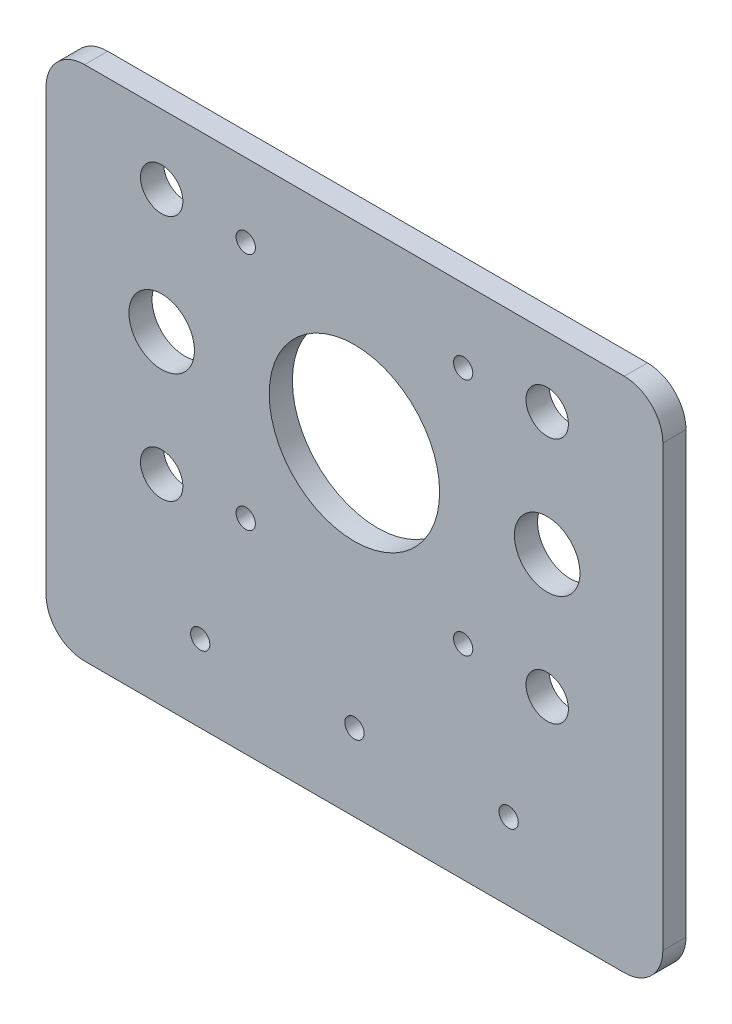
ISO-10303-21;
HEADER;
FILE_DESCRIPTION(('STEP AP214'),'2;1');
FILE_NAME('part.step','',(''),(''),'','','');
FILE_SCHEMA(('AUTOMOTIVE_DESIGN { 1 0 10303 214 1 1 1 1 }'));
ENDSEC;
DATA;
#1=APPLICATION_CONTEXT('core data for automotive mechanical design processes');
#2=APPLICATION_PROTOCOL_DEFINITION('international standard','automotive_design',2000,#1);
#3=PRODUCT_CONTEXT('',#1,'mechanical');
#4=PRODUCT('Part','Part','',(#3));
#5=PRODUCT_RELATED_PRODUCT_CATEGORY('part','',(#4));
#6=PRODUCT_DEFINITION_FORMATION('','',#4);
#7=PRODUCT_DEFINITION_CONTEXT('part definition',#1,'design');
#8=PRODUCT_DEFINITION('design','',#6,#7);
#9=PRODUCT_DEFINITION_SHAPE('','',#8);
#10=(LENGTH_UNIT() NAMED_UNIT(*) SI_UNIT(.MILLI.,.METRE.));
#11=(NAMED_UNIT(*) PLANE_ANGLE_UNIT() SI_UNIT($,.RADIAN.));
#12=(NAMED_UNIT(*) SI_UNIT($,.STERADIAN.) SOLID_ANGLE_UNIT());
#13=UNCERTAINTY_MEASURE_WITH_UNIT(LENGTH_MEASURE(1.E-05),#10,'distance_accuracy_value','');
#14=(GEOMETRIC_REPRESENTATION_CONTEXT(3) GLOBAL_UNCERTAINTY_ASSIGNED_CONTEXT((#13)) GLOBAL_UNIT_ASSIGNED_CONTEXT((#10,
#11,#12)) REPRESENTATION_CONTEXT('',''));
#15=CARTESIAN_POINT('',(0.,0.,0.));
#16=DIRECTION('',(0.,0.,1.));
#17=DIRECTION('',(1.,0.,0.));
#18=AXIS2_PLACEMENT_3D('',#15,#16,#17);
#19=CARTESIAN_POINT('',(-35.,-37.,3.));
#20=DIRECTION('',(0.,0.,1.));
#21=DIRECTION('',(1.,0.,0.));
#22=AXIS2_PLACEMENT_3D('',#19,#20,#21);
#23=PLANE('',#22);
#24=CARTESIAN_POINT('',(25.,0.,3.));
#25=DIRECTION('',(0.,0.,1.));
#26=DIRECTION('',(-1.,0.,0.));
#27=AXIS2_PLACEMENT_3D('',#24,#25,#26);
#28=CIRCLE('',#27,4.25);
#29=CARTESIAN_POINT('',(20.75,0.,3.));
#30=VERTEX_POINT('',#29);
#31=EDGE_CURVE('E301',#30,#30,#28,.T.);
#32=ORIENTED_EDGE('',*,*,#31,.F.);
#33=EDGE_LOOP('',(#32));
#34=FACE_BOUND('',#33,.T.);
#35=CARTESIAN_POINT('',(20.,-32.,3.));
#36=DIRECTION('',(0.,0.,1.));
#37=DIRECTION('',(1.,0.,0.));
#38=AXIS2_PLACEMENT_3D('',#35,#36,#37);
#39=CIRCLE('',#38,1.25);
#40=CARTESIAN_POINT('',(21.25,-32.,3.));
#41=VERTEX_POINT('',#40);
#42=EDGE_CURVE('E285',#41,#41,#39,.T.);
#43=ORIENTED_EDGE('',*,*,#42,.F.);
#44=EDGE_LOOP('',(#43));
#45=FACE_BOUND('',#44,.T.);
#46=CARTESIAN_POINT('',(0.,-32.,3.));
#47=DIRECTION('',(0.,0.,1.));
#48=DIRECTION('',(1.,0.,0.));
#49=AXIS2_PLACEMENT_3D('',#46,#47,#48);
#50=CIRCLE('',#49,1.25);
#51=CARTESIAN_POINT('',(1.25,-32.,3.));
#52=VERTEX_POINT('',#51);
#53=EDGE_CURVE('E269',#52,#52,#50,.T.);
#54=ORIENTED_EDGE('',*,*,#53,.F.);
#55=EDGE_LOOP('',(#54));
#56=FACE_BOUND('',#55,.T.);
#57=CARTESIAN_POINT('',(25.,-16.,3.));
#58=DIRECTION('',(0.,0.,1.));
#59=DIRECTION('',(-1.,0.,0.));
#60=AXIS2_PLACEMENT_3D('',#57,#58,#59);
#61=CIRCLE('',#60,2.75);
#62=CARTESIAN_POINT('',(22.25,-16.,3.));
#63=VERTEX_POINT('',#62);
#64=EDGE_CURVE('E253',#63,#63,#61,.T.);
#65=ORIENTED_EDGE('',*,*,#64,.F.);
#66=EDGE_LOOP('',(#65));
#67=FACE_BOUND('',#66,.T.);
#68=CARTESIAN_POINT('',(-25.,16.,3.));
#69=DIRECTION('',(0.,0.,1.));
#70=DIRECTION('',(1.,0.,0.));
#71=AXIS2_PLACEMENT_3D('',#68,#69,#70);
#72=CIRCLE('',#71,2.75);
#73=CARTESIAN_POINT('',(-22.25,16.,3.));
#74=VERTEX_POINT('',#73);
#75=EDGE_CURVE('E237',#74,#74,#72,.T.);
#76=ORIENTED_EDGE('',*,*,#75,.F.);
#77=EDGE_LOOP('',(#76));
#78=FACE_BOUND('',#77,.T.);
#79=CARTESIAN_POINT('',(14.1,15.5,3.));
#80=DIRECTION('',(0.,0.,1.));
#81=DIRECTION('',(1.,0.,0.));
#82=AXIS2_PLACEMENT_3D('',#79,#80,#81);
#83=CIRCLE('',#82,1.25);
#84=CARTESIAN_POINT('',(15.35,15.5,3.));
#85=VERTEX_POINT('',#84);
#86=EDGE_CURVE('E221',#85,#85,#83,.T.);
#87=ORIENTED_EDGE('',*,*,#86,.F.);
#88=EDGE_LOOP('',(#87));
#89=FACE_BOUND('',#88,.T.);
#90=CARTESIAN_POINT('',(0.,0.,3.));
#91=DIRECTION('',(0.,0.,1.));
#92=DIRECTION('',(1.,0.,0.));
#93=AXIS2_PLACEMENT_3D('',#90,#91,#92);
#94=CIRCLE('',#93,11.05);
#95=CARTESIAN_POINT('',(11.05,0.,3.));
#96=VERTEX_POINT('',#95);
#97=EDGE_CURVE('E146',#96,#96,#94,.T.);
#98=ORIENTED_EDGE('',*,*,#97,.F.);
#99=EDGE_LOOP('',(#98));
#100=FACE_BOUND('',#99,.T.);
#101=CARTESIAN_POINT('',(-35.,-37.,3.));
#102=DIRECTION('',(0.,0.,1.));
#103=DIRECTION('',(1.,0.,0.));
#104=AXIS2_PLACEMENT_3D('',#101,#102,#103);
#105=CIRCLE('',#104,5.);
#106=CARTESIAN_POINT('',(-40.,-37.,3.));
#107=VERTEX_POINT('',#106);
#108=CARTESIAN_POINT('',(-35.,-42.,3.));
#109=VERTEX_POINT('',#108);
#110=EDGE_CURVE('E164',#107,#109,#105,.T.);
#111=ORIENTED_EDGE('',*,*,#110,.T.);
#112=DIRECTION('',(1.,0.,0.));
#113=VECTOR('',#112,1.);
#114=CARTESIAN_POINT('',(-35.,-42.,3.));
#115=LINE('',#114,#113);
#116=CARTESIAN_POINT('',(35.,-42.,3.));
#117=VERTEX_POINT('',#116);
#118=EDGE_CURVE('E100',#109,#117,#115,.T.);
#119=ORIENTED_EDGE('',*,*,#118,.T.);
#120=CARTESIAN_POINT('',(35.,-37.,3.));
#121=DIRECTION('',(0.,0.,1.));
#122=DIRECTION('',(1.,0.,0.));
#123=AXIS2_PLACEMENT_3D('',#120,#121,#122);
#124=CIRCLE('',#123,5.);
#125=CARTESIAN_POINT('',(40.,-37.,3.));
#126=VERTEX_POINT('',#125);
#127=EDGE_CURVE('E185',#117,#126,#124,.T.);
#128=ORIENTED_EDGE('',*,*,#127,.T.);
#129=DIRECTION('',(0.,1.,0.));
#130=VECTOR('',#129,1.);
#131=CARTESIAN_POINT('',(40.,20.,3.));
#132=LINE('',#131,#130);
#133=CARTESIAN_POINT('',(40.,20.,3.));
#134=VERTEX_POINT('',#133);
#135=EDGE_CURVE('E199',#126,#134,#132,.T.);
#136=ORIENTED_EDGE('',*,*,#135,.T.);
#137=CARTESIAN_POINT('',(35.,20.,3.));
#138=DIRECTION('',(0.,0.,1.));
#139=DIRECTION('',(1.,0.,0.));
#140=AXIS2_PLACEMENT_3D('',#137,#138,#139);
#141=CIRCLE('',#140,5.);
#142=CARTESIAN_POINT('',(35.,25.,3.));
#143=VERTEX_POINT('',#142);
#144=EDGE_CURVE('E119',#134,#143,#141,.T.);
#145=ORIENTED_EDGE('',*,*,#144,.T.);
#146=DIRECTION('',(-1.,0.,0.));
#147=VECTOR('',#146,1.);
#148=CARTESIAN_POINT('',(-35.,25.,3.));
#149=LINE('',#148,#147);
#150=CARTESIAN_POINT('',(-35.,25.,3.));
#151=VERTEX_POINT('',#150);
#152=EDGE_CURVE('E113',#143,#151,#149,.T.);
#153=ORIENTED_EDGE('',*,*,#152,.T.);
#154=CARTESIAN_POINT('',(-35.,20.,3.));
#155=DIRECTION('',(0.,0.,1.));
#156=DIRECTION('',(1.,0.,0.));
#157=AXIS2_PLACEMENT_3D('',#154,#155,#156);
#158=CIRCLE('',#157,5.);
#159=CARTESIAN_POINT('',(-40.,20.,3.));
#160=VERTEX_POINT('',#159);
#161=EDGE_CURVE('E117',#151,#160,#158,.T.);
#162=ORIENTED_EDGE('',*,*,#161,.T.);
#163=DIRECTION('',(0.,-1.,0.));
#164=VECTOR('',#163,1.);
#165=CARTESIAN_POINT('',(-40.,20.,3.));
#166=LINE('',#165,#164);
#167=EDGE_CURVE('E57',#160,#107,#166,.T.);
#168=ORIENTED_EDGE('',*,*,#167,.T.);
#169=EDGE_LOOP('',(#111,#119,#128,#136,#145,#153,#162,#168));
#170=FACE_BOUND('',#169,.T.);
#171=CARTESIAN_POINT('',(-14.1,15.5,3.));
#172=DIRECTION('',(0.,0.,1.));
#173=DIRECTION('',(1.,0.,0.));
#174=AXIS2_PLACEMENT_3D('',#171,#172,#173);
#175=CIRCLE('',#174,1.25);
#176=CARTESIAN_POINT('',(-12.85,15.5,3.));
#177=VERTEX_POINT('',#176);
#178=EDGE_CURVE('E213',#177,#177,#175,.T.);
#179=ORIENTED_EDGE('',*,*,#178,.F.);
#180=EDGE_LOOP('',(#179));
#181=FACE_BOUND('',#180,.T.);
#182=CARTESIAN_POINT('',(14.1,-15.5,3.));
#183=DIRECTION('',(0.,0.,1.));
#184=DIRECTION('',(-1.,0.,0.));
#185=AXIS2_PLACEMENT_3D('',#182,#183,#184);
#186=CIRCLE('',#185,1.25);
#187=CARTESIAN_POINT('',(12.85,-15.5,3.));
#188=VERTEX_POINT('',#187);
#189=EDGE_CURVE('E229',#188,#188,#186,.T.);
#190=ORIENTED_EDGE('',*,*,#189,.F.);
#191=EDGE_LOOP('',(#190));
#192=FACE_BOUND('',#191,.T.);
#193=CARTESIAN_POINT('',(-25.,-16.,3.));
#194=DIRECTION('',(0.,0.,1.));
#195=DIRECTION('',(1.,0.,0.));
#196=AXIS2_PLACEMENT_3D('',#193,#194,#195);
#197=CIRCLE('',#196,2.75);
#198=CARTESIAN_POINT('',(-22.25,-16.,3.));
#199=VERTEX_POINT('',#198);
#200=EDGE_CURVE('E245',#199,#199,#197,.T.);
#201=ORIENTED_EDGE('',*,*,#200,.F.);
#202=EDGE_LOOP('',(#201));
#203=FACE_BOUND('',#202,.T.);
#204=CARTESIAN_POINT('',(25.,16.,3.));
#205=DIRECTION('',(0.,0.,1.));
#206=DIRECTION('',(-1.,0.,0.));
#207=AXIS2_PLACEMENT_3D('',#204,#205,#206);
#208=CIRCLE('',#207,2.75);
#209=CARTESIAN_POINT('',(22.25,16.,3.));
#210=VERTEX_POINT('',#209);
#211=EDGE_CURVE('E261',#210,#210,#208,.T.);
#212=ORIENTED_EDGE('',*,*,#211,.F.);
#213=EDGE_LOOP('',(#212));
#214=FACE_BOUND('',#213,.T.);
#215=CARTESIAN_POINT('',(-20.,-32.,3.));
#216=DIRECTION('',(0.,0.,1.));
#217=DIRECTION('',(1.,0.,0.));
#218=AXIS2_PLACEMENT_3D('',#215,#216,#217);
#219=CIRCLE('',#218,1.25);
#220=CARTESIAN_POINT('',(-18.75,-32.,3.));
#221=VERTEX_POINT('',#220);
#222=EDGE_CURVE('E277',#221,#221,#219,.T.);
#223=ORIENTED_EDGE('',*,*,#222,.F.);
#224=EDGE_LOOP('',(#223));
#225=FACE_BOUND('',#224,.T.);
#226=CARTESIAN_POINT('',(-25.,0.,3.));
#227=DIRECTION('',(0.,0.,1.));
#228=DIRECTION('',(1.,0.,0.));
#229=AXIS2_PLACEMENT_3D('',#226,#227,#228);
#230=CIRCLE('',#229,4.25);
#231=CARTESIAN_POINT('',(-20.75,0.,3.));
#232=VERTEX_POINT('',#231);
#233=EDGE_CURVE('E293',#232,#232,#230,.T.);
#234=ORIENTED_EDGE('',*,*,#233,.F.);
#235=EDGE_LOOP('',(#234));
#236=FACE_BOUND('',#235,.T.);
#237=CARTESIAN_POINT('',(-14.1,-15.5,3.));
#238=DIRECTION('',(0.,0.,1.));
#239=DIRECTION('',(-1.,0.,0.));
#240=AXIS2_PLACEMENT_3D('',#237,#238,#239);
#241=CIRCLE('',#240,1.25);
#242=CARTESIAN_POINT('',(-15.35,-15.5,3.));
#243=VERTEX_POINT('',#242);
#244=EDGE_CURVE('E309',#243,#243,#241,.T.);
#245=ORIENTED_EDGE('',*,*,#244,.F.);
#246=EDGE_LOOP('',(#245));
#247=FACE_BOUND('',#246,.T.);
#248=ADVANCED_FACE('F39',(#34,#45,#56,#67,#78,#89,#100,#170,#181,#192,#203,#214,#225,#236,#247),
#23,.T.);
#249=CARTESIAN_POINT('',(-35.,-37.,0.));
#250=DIRECTION('',(0.,0.,1.));
#251=DIRECTION('',(1.,0.,0.));
#252=AXIS2_PLACEMENT_3D('',#249,#250,#251);
#253=PLANE('',#252);
#254=CARTESIAN_POINT('',(-35.,-37.,0.));
#255=DIRECTION('',(0.,0.,1.));
#256=DIRECTION('',(1.,0.,0.));
#257=AXIS2_PLACEMENT_3D('',#254,#255,#256);
#258=CIRCLE('',#257,5.);
#259=CARTESIAN_POINT('',(-40.,-37.,0.));
#260=VERTEX_POINT('',#259);
#261=CARTESIAN_POINT('',(-35.,-42.,0.));
#262=VERTEX_POINT('',#261);
#263=EDGE_CURVE('E141',#260,#262,#258,.T.);
#264=ORIENTED_EDGE('',*,*,#263,.F.);
#265=DIRECTION('',(0.,-1.,0.));
#266=VECTOR('',#265,1.);
#267=CARTESIAN_POINT('',(-40.,20.,0.));
#268=LINE('',#267,#266);
#269=CARTESIAN_POINT('',(-40.,20.,0.));
#270=VERTEX_POINT('',#269);
#271=EDGE_CURVE('E92',#270,#260,#268,.T.);
#272=ORIENTED_EDGE('',*,*,#271,.F.);
#273=CARTESIAN_POINT('',(-35.,20.,0.));
#274=DIRECTION('',(0.,0.,1.));
#275=DIRECTION('',(1.,0.,0.));
#276=AXIS2_PLACEMENT_3D('',#273,#274,#275);
#277=CIRCLE('',#276,5.);
#278=CARTESIAN_POINT('',(-35.,25.,0.));
#279=VERTEX_POINT('',#278);
#280=EDGE_CURVE('E86',#279,#270,#277,.T.);
#281=ORIENTED_EDGE('',*,*,#280,.F.);
#282=DIRECTION('',(-1.,0.,0.));
#283=VECTOR('',#282,1.);
#284=CARTESIAN_POINT('',(-35.,25.,0.));
#285=LINE('',#284,#283);
#286=CARTESIAN_POINT('',(35.,25.,0.));
#287=VERTEX_POINT('',#286);
#288=EDGE_CURVE('E128',#287,#279,#285,.T.);
#289=ORIENTED_EDGE('',*,*,#288,.F.);
#290=CARTESIAN_POINT('',(35.,20.,0.));
#291=DIRECTION('',(0.,0.,1.));
#292=DIRECTION('',(1.,0.,0.));
#293=AXIS2_PLACEMENT_3D('',#290,#291,#292);
#294=CIRCLE('',#293,5.);
#295=CARTESIAN_POINT('',(40.,20.,0.));
#296=VERTEX_POINT('',#295);
#297=EDGE_CURVE('E155',#296,#287,#294,.T.);
#298=ORIENTED_EDGE('',*,*,#297,.F.);
#299=DIRECTION('',(0.,1.,0.));
#300=VECTOR('',#299,1.);
#301=CARTESIAN_POINT('',(40.,20.,0.));
#302=LINE('',#301,#300);
#303=CARTESIAN_POINT('',(40.,-37.,0.));
#304=VERTEX_POINT('',#303);
#305=EDGE_CURVE('E152',#304,#296,#302,.T.);
#306=ORIENTED_EDGE('',*,*,#305,.F.);
#307=CARTESIAN_POINT('',(35.,-37.,0.));
#308=DIRECTION('',(0.,0.,1.));
#309=DIRECTION('',(1.,0.,0.));
#310=AXIS2_PLACEMENT_3D('',#307,#308,#309);
#311=CIRCLE('',#310,5.);
#312=CARTESIAN_POINT('',(35.,-42.,0.));
#313=VERTEX_POINT('',#312);
#314=EDGE_CURVE('E149',#313,#304,#311,.T.);
#315=ORIENTED_EDGE('',*,*,#314,.F.);
#316=DIRECTION('',(1.,0.,0.));
#317=VECTOR('',#316,1.);
#318=CARTESIAN_POINT('',(-35.,-42.,0.));
#319=LINE('',#318,#317);
#320=EDGE_CURVE('E145',#262,#313,#319,.T.);
#321=ORIENTED_EDGE('',*,*,#320,.F.);
#322=EDGE_LOOP('',(#264,#272,#281,#289,#298,#306,#315,#321));
#323=FACE_BOUND('',#322,.T.);
#324=CARTESIAN_POINT('',(0.,0.,0.));
#325=DIRECTION('',(0.,0.,1.));
#326=DIRECTION('',(1.,0.,0.));
#327=AXIS2_PLACEMENT_3D('',#324,#325,#326);
#328=CIRCLE('',#327,11.05);
#329=CARTESIAN_POINT('',(11.05,0.,0.));
#330=VERTEX_POINT('',#329);
#331=EDGE_CURVE('E209',#330,#330,#328,.T.);
#332=ORIENTED_EDGE('',*,*,#331,.T.);
#333=EDGE_LOOP('',(#332));
#334=FACE_BOUND('',#333,.T.);
#335=CARTESIAN_POINT('',(-14.1,15.5,0.));
#336=DIRECTION('',(0.,0.,1.));
#337=DIRECTION('',(1.,0.,0.));
#338=AXIS2_PLACEMENT_3D('',#335,#336,#337);
#339=CIRCLE('',#338,1.25);
#340=CARTESIAN_POINT('',(-12.85,15.5,0.));
#341=VERTEX_POINT('',#340);
#342=EDGE_CURVE('E217',#341,#341,#339,.T.);
#343=ORIENTED_EDGE('',*,*,#342,.T.);
#344=EDGE_LOOP('',(#343));
#345=FACE_BOUND('',#344,.T.);
#346=CARTESIAN_POINT('',(14.1,15.5,0.));
#347=DIRECTION('',(0.,0.,1.));
#348=DIRECTION('',(1.,0.,0.));
#349=AXIS2_PLACEMENT_3D('',#346,#347,#348);
#350=CIRCLE('',#349,1.25);
#351=CARTESIAN_POINT('',(15.35,15.5,0.));
#352=VERTEX_POINT('',#351);
#353=EDGE_CURVE('E225',#352,#352,#350,.T.);
#354=ORIENTED_EDGE('',*,*,#353,.T.);
#355=EDGE_LOOP('',(#354));
#356=FACE_BOUND('',#355,.T.);
#357=CARTESIAN_POINT('',(14.1,-15.5,0.));
#358=DIRECTION('',(0.,0.,1.));
#359=DIRECTION('',(-1.,0.,0.));
#360=AXIS2_PLACEMENT_3D('',#357,#358,#359);
#361=CIRCLE('',#360,1.25);
#362=CARTESIAN_POINT('',(12.85,-15.5,0.));
#363=VERTEX_POINT('',#362);
#364=EDGE_CURVE('E233',#363,#363,#361,.T.);
#365=ORIENTED_EDGE('',*,*,#364,.T.);
#366=EDGE_LOOP('',(#365));
#367=FACE_BOUND('',#366,.T.);
#368=CARTESIAN_POINT('',(-25.,16.,0.));
#369=DIRECTION('',(0.,0.,1.));
#370=DIRECTION('',(1.,0.,0.));
#371=AXIS2_PLACEMENT_3D('',#368,#369,#370);
#372=CIRCLE('',#371,2.75);
#373=CARTESIAN_POINT('',(-22.25,16.,0.));
#374=VERTEX_POINT('',#373);
#375=EDGE_CURVE('E241',#374,#374,#372,.T.);
#376=ORIENTED_EDGE('',*,*,#375,.T.);
#377=EDGE_LOOP('',(#376));
#378=FACE_BOUND('',#377,.T.);
#379=CARTESIAN_POINT('',(-25.,-16.,0.));
#380=DIRECTION('',(0.,0.,1.));
#381=DIRECTION('',(1.,0.,0.));
#382=AXIS2_PLACEMENT_3D('',#379,#380,#381);
#383=CIRCLE('',#382,2.75);
#384=CARTESIAN_POINT('',(-22.25,-16.,0.));
#385=VERTEX_POINT('',#384);
#386=EDGE_CURVE('E249',#385,#385,#383,.T.);
#387=ORIENTED_EDGE('',*,*,#386,.T.);
#388=EDGE_LOOP('',(#387));
#389=FACE_BOUND('',#388,.T.);
#390=CARTESIAN_POINT('',(25.,-16.,0.));
#391=DIRECTION('',(0.,0.,1.));
#392=DIRECTION('',(-1.,0.,0.));
#393=AXIS2_PLACEMENT_3D('',#390,#391,#392);
#394=CIRCLE('',#393,2.75);
#395=CARTESIAN_POINT('',(22.25,-16.,0.));
#396=VERTEX_POINT('',#395);
#397=EDGE_CURVE('E257',#396,#396,#394,.T.);
#398=ORIENTED_EDGE('',*,*,#397,.T.);
#399=EDGE_LOOP('',(#398));
#400=FACE_BOUND('',#399,.T.);
#401=CARTESIAN_POINT('',(25.,16.,0.));
#402=DIRECTION('',(0.,0.,1.));
#403=DIRECTION('',(-1.,0.,0.));
#404=AXIS2_PLACEMENT_3D('',#401,#402,#403);
#405=CIRCLE('',#404,2.75);
#406=CARTESIAN_POINT('',(22.25,16.,0.));
#407=VERTEX_POINT('',#406);
#408=EDGE_CURVE('E265',#407,#407,#405,.T.);
#409=ORIENTED_EDGE('',*,*,#408,.T.);
#410=EDGE_LOOP('',(#409));
#411=FACE_BOUND('',#410,.T.);
#412=CARTESIAN_POINT('',(0.,-32.,0.));
#413=DIRECTION('',(0.,0.,1.));
#414=DIRECTION('',(1.,0.,0.));
#415=AXIS2_PLACEMENT_3D('',#412,#413,#414);
#416=CIRCLE('',#415,1.25);
#417=CARTESIAN_POINT('',(1.25,-32.,0.));
#418=VERTEX_POINT('',#417);
#419=EDGE_CURVE('E273',#418,#418,#416,.T.);
#420=ORIENTED_EDGE('',*,*,#419,.T.);
#421=EDGE_LOOP('',(#420));
#422=FACE_BOUND('',#421,.T.);
#423=CARTESIAN_POINT('',(-20.,-32.,0.));
#424=DIRECTION('',(0.,0.,1.));
#425=DIRECTION('',(1.,0.,0.));
#426=AXIS2_PLACEMENT_3D('',#423,#424,#425);
#427=CIRCLE('',#426,1.25);
#428=CARTESIAN_POINT('',(-18.75,-32.,0.));
#429=VERTEX_POINT('',#428);
#430=EDGE_CURVE('E281',#429,#429,#427,.T.);
#431=ORIENTED_EDGE('',*,*,#430,.T.);
#432=EDGE_LOOP('',(#431));
#433=FACE_BOUND('',#432,.T.);
#434=CARTESIAN_POINT('',(20.,-32.,0.));
#435=DIRECTION('',(0.,0.,1.));
#436=DIRECTION('',(1.,0.,0.));
#437=AXIS2_PLACEMENT_3D('',#434,#435,#436);
#438=CIRCLE('',#437,1.25);
#439=CARTESIAN_POINT('',(21.25,-32.,0.));
#440=VERTEX_POINT('',#439);
#441=EDGE_CURVE('E289',#440,#440,#438,.T.);
#442=ORIENTED_EDGE('',*,*,#441,.T.);
#443=EDGE_LOOP('',(#442));
#444=FACE_BOUND('',#443,.T.);
#445=CARTESIAN_POINT('',(-25.,0.,0.));
#446=DIRECTION('',(0.,0.,1.));
#447=DIRECTION('',(1.,0.,0.));
#448=AXIS2_PLACEMENT_3D('',#445,#446,#447);
#449=CIRCLE('',#448,4.25);
#450=CARTESIAN_POINT('',(-20.75,0.,0.));
#451=VERTEX_POINT('',#450);
#452=EDGE_CURVE('E297',#451,#451,#449,.T.);
#453=ORIENTED_EDGE('',*,*,#452,.T.);
#454=EDGE_LOOP('',(#453));
#455=FACE_BOUND('',#454,.T.);
#456=CARTESIAN_POINT('',(25.,0.,0.));
#457=DIRECTION('',(0.,0.,1.));
#458=DIRECTION('',(-1.,0.,0.));
#459=AXIS2_PLACEMENT_3D('',#456,#457,#458);
#460=CIRCLE('',#459,4.25);
#461=CARTESIAN_POINT('',(20.75,0.,0.));
#462=VERTEX_POINT('',#461);
#463=EDGE_CURVE('E305',#462,#462,#460,.T.);
#464=ORIENTED_EDGE('',*,*,#463,.T.);
#465=EDGE_LOOP('',(#464));
#466=FACE_BOUND('',#465,.T.);
#467=CARTESIAN_POINT('',(-14.1,-15.5,0.));
#468=DIRECTION('',(0.,0.,1.));
#469=DIRECTION('',(-1.,0.,0.));
#470=AXIS2_PLACEMENT_3D('',#467,#468,#469);
#471=CIRCLE('',#470,1.25);
#472=CARTESIAN_POINT('',(-15.35,-15.5,0.));
#473=VERTEX_POINT('',#472);
#474=EDGE_CURVE('E313',#473,#473,#471,.T.);
#475=ORIENTED_EDGE('',*,*,#474,.T.);
#476=EDGE_LOOP('',(#475));
#477=FACE_BOUND('',#476,.T.);
#478=ADVANCED_FACE('F189',(#323,#334,#345,#356,#367,#378,#389,#400,#411,#422,#433,#444,#455,
#466,#477),#253,.F.);
#479=CARTESIAN_POINT('',(-35.,-37.,3.));
#480=DIRECTION('',(0.,0.,-1.));
#481=DIRECTION('',(-1.,0.,0.));
#482=AXIS2_PLACEMENT_3D('',#479,#480,#481);
#483=CYLINDRICAL_SURFACE('',#482,5.);
#484=ORIENTED_EDGE('',*,*,#263,.T.);
#485=DIRECTION('',(0.,0.,-1.));
#486=VECTOR('',#485,1.);
#487=CARTESIAN_POINT('',(-35.,-42.,3.));
#488=LINE('',#487,#486);
#489=EDGE_CURVE('E11',#109,#262,#488,.T.);
#490=ORIENTED_EDGE('',*,*,#489,.F.);
#491=ORIENTED_EDGE('',*,*,#110,.F.);
#492=DIRECTION('',(0.,0.,-1.));
#493=VECTOR('',#492,1.);
#494=CARTESIAN_POINT('',(-40.,-37.,3.));
#495=LINE('',#494,#493);
#496=EDGE_CURVE('E137',#107,#260,#495,.T.);
#497=ORIENTED_EDGE('',*,*,#496,.T.);
#498=EDGE_LOOP('',(#484,#490,#491,#497));
#499=FACE_BOUND('',#498,.T.);
#500=ADVANCED_FACE('F41',(#499),#483,.T.);
#501=CARTESIAN_POINT('',(-35.,-42.,3.));
#502=DIRECTION('',(0.,1.,0.));
#503=DIRECTION('',(0.,0.,1.));
#504=AXIS2_PLACEMENT_3D('',#501,#502,#503);
#505=PLANE('',#504);
#506=ORIENTED_EDGE('',*,*,#320,.T.);
#507=DIRECTION('',(0.,0.,-1.));
#508=VECTOR('',#507,1.);
#509=CARTESIAN_POINT('',(35.,-42.,3.));
#510=LINE('',#509,#508);
#511=EDGE_CURVE('E49',#117,#313,#510,.T.);
#512=ORIENTED_EDGE('',*,*,#511,.F.);
#513=ORIENTED_EDGE('',*,*,#118,.F.);
#514=ORIENTED_EDGE('',*,*,#489,.T.);
#515=EDGE_LOOP('',(#506,#512,#513,#514));
#516=FACE_BOUND('',#515,.T.);
#517=ADVANCED_FACE('F349',(#516),#505,.F.);
#518=CARTESIAN_POINT('',(35.,-37.,3.));
#519=DIRECTION('',(0.,0.,-1.));
#520=DIRECTION('',(-1.,0.,0.));
#521=AXIS2_PLACEMENT_3D('',#518,#519,#520);
#522=CYLINDRICAL_SURFACE('',#521,5.);
#523=ORIENTED_EDGE('',*,*,#314,.T.);
#524=DIRECTION('',(0.,0.,-1.));
#525=VECTOR('',#524,1.);
#526=CARTESIAN_POINT('',(40.,-37.,3.));
#527=LINE('',#526,#525);
#528=EDGE_CURVE('E175',#126,#304,#527,.T.);
#529=ORIENTED_EDGE('',*,*,#528,.F.);
#530=ORIENTED_EDGE('',*,*,#127,.F.);
#531=ORIENTED_EDGE('',*,*,#511,.T.);
#532=EDGE_LOOP('',(#523,#529,#530,#531));
#533=FACE_BOUND('',#532,.T.);
#534=ADVANCED_FACE('F183',(#533),#522,.T.);
#535=CARTESIAN_POINT('',(40.,20.,3.));
#536=DIRECTION('',(-1.,0.,0.));
#537=DIRECTION('',(0.,0.,1.));
#538=AXIS2_PLACEMENT_3D('',#535,#536,#537);
#539=PLANE('',#538);
#540=ORIENTED_EDGE('',*,*,#305,.T.);
#541=DIRECTION('',(0.,0.,-1.));
#542=VECTOR('',#541,1.);
#543=CARTESIAN_POINT('',(40.,20.,3.));
#544=LINE('',#543,#542);
#545=EDGE_CURVE('E171',#134,#296,#544,.T.);
#546=ORIENTED_EDGE('',*,*,#545,.F.);
#547=ORIENTED_EDGE('',*,*,#135,.F.);
#548=ORIENTED_EDGE('',*,*,#528,.T.);
#549=EDGE_LOOP('',(#540,#546,#547,#548));
#550=FACE_BOUND('',#549,.T.);
#551=ADVANCED_FACE('F194',(#550),#539,.F.);
#552=CARTESIAN_POINT('',(35.,20.,3.));
#553=DIRECTION('',(0.,0.,-1.));
#554=DIRECTION('',(-1.,0.,0.));
#555=AXIS2_PLACEMENT_3D('',#552,#553,#554);
#556=CYLINDRICAL_SURFACE('',#555,5.);
#557=ORIENTED_EDGE('',*,*,#297,.T.);
#558=DIRECTION('',(0.,0.,-1.));
#559=VECTOR('',#558,1.);
#560=CARTESIAN_POINT('',(35.,25.,3.));
#561=LINE('',#560,#559);
#562=EDGE_CURVE('E130',#143,#287,#561,.T.);
#563=ORIENTED_EDGE('',*,*,#562,.F.);
#564=ORIENTED_EDGE('',*,*,#144,.F.);
#565=ORIENTED_EDGE('',*,*,#545,.T.);
#566=EDGE_LOOP('',(#557,#563,#564,#565));
#567=FACE_BOUND('',#566,.T.);
#568=ADVANCED_FACE('F197',(#567),#556,.T.);
#569=CARTESIAN_POINT('',(-35.,25.,3.));
#570=DIRECTION('',(0.,-1.,0.));
#571=DIRECTION('',(0.,0.,-1.));
#572=AXIS2_PLACEMENT_3D('',#569,#570,#571);
#573=PLANE('',#572);
#574=ORIENTED_EDGE('',*,*,#288,.T.);
#575=DIRECTION('',(0.,0.,-1.));
#576=VECTOR('',#575,1.);
#577=CARTESIAN_POINT('',(-35.,25.,3.));
#578=LINE('',#577,#576);
#579=EDGE_CURVE('E125',#151,#279,#578,.T.);
#580=ORIENTED_EDGE('',*,*,#579,.F.);
#581=ORIENTED_EDGE('',*,*,#152,.F.);
#582=ORIENTED_EDGE('',*,*,#562,.T.);
#583=EDGE_LOOP('',(#574,#580,#581,#582));
#584=FACE_BOUND('',#583,.T.);
#585=ADVANCED_FACE('F126',(#584),#573,.F.);
#586=CARTESIAN_POINT('',(-35.,20.,3.));
#587=DIRECTION('',(0.,0.,-1.));
#588=DIRECTION('',(-1.,0.,0.));
#589=AXIS2_PLACEMENT_3D('',#586,#587,#588);
#590=CYLINDRICAL_SURFACE('',#589,5.);
#591=ORIENTED_EDGE('',*,*,#280,.T.);
#592=DIRECTION('',(0.,0.,-1.));
#593=VECTOR('',#592,1.);
#594=CARTESIAN_POINT('',(-40.,20.,3.));
#595=LINE('',#594,#593);
#596=EDGE_CURVE('E131',#160,#270,#595,.T.);
#597=ORIENTED_EDGE('',*,*,#596,.F.);
#598=ORIENTED_EDGE('',*,*,#161,.F.);
#599=ORIENTED_EDGE('',*,*,#579,.T.);
#600=EDGE_LOOP('',(#591,#597,#598,#599));
#601=FACE_BOUND('',#600,.T.);
#602=ADVANCED_FACE('F133',(#601),#590,.T.);
#603=CARTESIAN_POINT('',(-40.,20.,3.));
#604=DIRECTION('',(1.,0.,0.));
#605=DIRECTION('',(0.,0.,-1.));
#606=AXIS2_PLACEMENT_3D('',#603,#604,#605);
#607=PLANE('',#606);
#608=ORIENTED_EDGE('',*,*,#271,.T.);
#609=ORIENTED_EDGE('',*,*,#496,.F.);
#610=ORIENTED_EDGE('',*,*,#167,.F.);
#611=ORIENTED_EDGE('',*,*,#596,.T.);
#612=EDGE_LOOP('',(#608,#609,#610,#611));
#613=FACE_BOUND('',#612,.T.);
#614=ADVANCED_FACE('F337',(#613),#607,.F.);
#615=CARTESIAN_POINT('',(0.,0.,3.));
#616=DIRECTION('',(0.,0.,-1.));
#617=DIRECTION('',(-1.,0.,0.));
#618=AXIS2_PLACEMENT_3D('',#615,#616,#617);
#619=CYLINDRICAL_SURFACE('',#618,11.05);
#620=ORIENTED_EDGE('',*,*,#97,.T.);
#621=EDGE_LOOP('',(#620));
#622=FACE_BOUND('',#621,.T.);
#623=ORIENTED_EDGE('',*,*,#331,.F.);
#624=EDGE_LOOP('',(#623));
#625=FACE_BOUND('',#624,.T.);
#626=ADVANCED_FACE('F334',(#622,#625),#619,.F.);
#627=CARTESIAN_POINT('',(-14.1,15.5,3.));
#628=DIRECTION('',(0.,0.,-1.));
#629=DIRECTION('',(-1.,0.,0.));
#630=AXIS2_PLACEMENT_3D('',#627,#628,#629);
#631=CYLINDRICAL_SURFACE('',#630,1.25);
#632=ORIENTED_EDGE('',*,*,#178,.T.);
#633=EDGE_LOOP('',(#632));
#634=FACE_BOUND('',#633,.T.);
#635=ORIENTED_EDGE('',*,*,#342,.F.);
#636=EDGE_LOOP('',(#635));
#637=FACE_BOUND('',#636,.T.);
#638=ADVANCED_FACE('F413',(#634,#637),#631,.F.);
#639=CARTESIAN_POINT('',(14.1,15.5,3.));
#640=DIRECTION('',(0.,0.,-1.));
#641=DIRECTION('',(-1.,0.,0.));
#642=AXIS2_PLACEMENT_3D('',#639,#640,#641);
#643=CYLINDRICAL_SURFACE('',#642,1.25);
#644=ORIENTED_EDGE('',*,*,#86,.T.);
#645=EDGE_LOOP('',(#644));
#646=FACE_BOUND('',#645,.T.);
#647=ORIENTED_EDGE('',*,*,#353,.F.);
#648=EDGE_LOOP('',(#647));
#649=FACE_BOUND('',#648,.T.);
#650=ADVANCED_FACE('F421',(#646,#649),#643,.F.);
#651=CARTESIAN_POINT('',(14.1,-15.5,3.));
#652=DIRECTION('',(0.,0.,-1.));
#653=DIRECTION('',(-1.,0.,0.));
#654=AXIS2_PLACEMENT_3D('',#651,#652,#653);
#655=CYLINDRICAL_SURFACE('',#654,1.25);
#656=ORIENTED_EDGE('',*,*,#189,.T.);
#657=EDGE_LOOP('',(#656));
#658=FACE_BOUND('',#657,.T.);
#659=ORIENTED_EDGE('',*,*,#364,.F.);
#660=EDGE_LOOP('',(#659));
#661=FACE_BOUND('',#660,.T.);
#662=ADVANCED_FACE('F429',(#658,#661),#655,.F.);
#663=CARTESIAN_POINT('',(-25.,16.,3.));
#664=DIRECTION('',(0.,0.,-1.));
#665=DIRECTION('',(-1.,0.,0.));
#666=AXIS2_PLACEMENT_3D('',#663,#664,#665);
#667=CYLINDRICAL_SURFACE('',#666,2.75);
#668=ORIENTED_EDGE('',*,*,#75,.T.);
#669=EDGE_LOOP('',(#668));
#670=FACE_BOUND('',#669,.T.);
#671=ORIENTED_EDGE('',*,*,#375,.F.);
#672=EDGE_LOOP('',(#671));
#673=FACE_BOUND('',#672,.T.);
#674=ADVANCED_FACE('F438',(#670,#673),#667,.F.);
#675=CARTESIAN_POINT('',(-25.,-16.,3.));
#676=DIRECTION('',(0.,0.,-1.));
#677=DIRECTION('',(-1.,0.,0.));
#678=AXIS2_PLACEMENT_3D('',#675,#676,#677);
#679=CYLINDRICAL_SURFACE('',#678,2.75);
#680=ORIENTED_EDGE('',*,*,#200,.T.);
#681=EDGE_LOOP('',(#680));
#682=FACE_BOUND('',#681,.T.);
#683=ORIENTED_EDGE('',*,*,#386,.F.);
#684=EDGE_LOOP('',(#683));
#685=FACE_BOUND('',#684,.T.);
#686=ADVANCED_FACE('F447',(#682,#685),#679,.F.);
#687=CARTESIAN_POINT('',(25.,-16.,3.));
#688=DIRECTION('',(0.,0.,-1.));
#689=DIRECTION('',(-1.,0.,0.));
#690=AXIS2_PLACEMENT_3D('',#687,#688,#689);
#691=CYLINDRICAL_SURFACE('',#690,2.75);
#692=ORIENTED_EDGE('',*,*,#64,.T.);
#693=EDGE_LOOP('',(#692));
#694=FACE_BOUND('',#693,.T.);
#695=ORIENTED_EDGE('',*,*,#397,.F.);
#696=EDGE_LOOP('',(#695));
#697=FACE_BOUND('',#696,.T.);
#698=ADVANCED_FACE('F456',(#694,#697),#691,.F.);
#699=CARTESIAN_POINT('',(25.,16.,3.));
#700=DIRECTION('',(0.,0.,-1.));
#701=DIRECTION('',(-1.,0.,0.));
#702=AXIS2_PLACEMENT_3D('',#699,#700,#701);
#703=CYLINDRICAL_SURFACE('',#702,2.75);
#704=ORIENTED_EDGE('',*,*,#211,.T.);
#705=EDGE_LOOP('',(#704));
#706=FACE_BOUND('',#705,.T.);
#707=ORIENTED_EDGE('',*,*,#408,.F.);
#708=EDGE_LOOP('',(#707));
#709=FACE_BOUND('',#708,.T.);
#710=ADVANCED_FACE('F465',(#706,#709),#703,.F.);
#711=CARTESIAN_POINT('',(0.,-32.,3.));
#712=DIRECTION('',(0.,0.,-1.));
#713=DIRECTION('',(-1.,0.,0.));
#714=AXIS2_PLACEMENT_3D('',#711,#712,#713);
#715=CYLINDRICAL_SURFACE('',#714,1.25);
#716=ORIENTED_EDGE('',*,*,#53,.T.);
#717=EDGE_LOOP('',(#716));
#718=FACE_BOUND('',#717,.T.);
#719=ORIENTED_EDGE('',*,*,#419,.F.);
#720=EDGE_LOOP('',(#719));
#721=FACE_BOUND('',#720,.T.);
#722=ADVANCED_FACE('F474',(#718,#721),#715,.F.);
#723=CARTESIAN_POINT('',(-20.,-32.,3.));
#724=DIRECTION('',(0.,0.,-1.));
#725=DIRECTION('',(-1.,0.,0.));
#726=AXIS2_PLACEMENT_3D('',#723,#724,#725);
#727=CYLINDRICAL_SURFACE('',#726,1.25);
#728=ORIENTED_EDGE('',*,*,#222,.T.);
#729=EDGE_LOOP('',(#728));
#730=FACE_BOUND('',#729,.T.);
#731=ORIENTED_EDGE('',*,*,#430,.F.);
#732=EDGE_LOOP('',(#731));
#733=FACE_BOUND('',#732,.T.);
#734=ADVANCED_FACE('F483',(#730,#733),#727,.F.);
#735=CARTESIAN_POINT('',(20.,-32.,3.));
#736=DIRECTION('',(0.,0.,-1.));
#737=DIRECTION('',(-1.,0.,0.));
#738=AXIS2_PLACEMENT_3D('',#735,#736,#737);
#739=CYLINDRICAL_SURFACE('',#738,1.25);
#740=ORIENTED_EDGE('',*,*,#42,.T.);
#741=EDGE_LOOP('',(#740));
#742=FACE_BOUND('',#741,.T.);
#743=ORIENTED_EDGE('',*,*,#441,.F.);
#744=EDGE_LOOP('',(#743));
#745=FACE_BOUND('',#744,.T.);
#746=ADVANCED_FACE('F492',(#742,#745),#739,.F.);
#747=CARTESIAN_POINT('',(-25.,0.,3.));
#748=DIRECTION('',(0.,0.,-1.));
#749=DIRECTION('',(-1.,0.,0.));
#750=AXIS2_PLACEMENT_3D('',#747,#748,#749);
#751=CYLINDRICAL_SURFACE('',#750,4.25);
#752=ORIENTED_EDGE('',*,*,#233,.T.);
#753=EDGE_LOOP('',(#752));
#754=FACE_BOUND('',#753,.T.);
#755=ORIENTED_EDGE('',*,*,#452,.F.);
#756=EDGE_LOOP('',(#755));
#757=FACE_BOUND('',#756,.T.);
#758=ADVANCED_FACE('F501',(#754,#757),#751,.F.);
#759=CARTESIAN_POINT('',(25.,0.,3.));
#760=DIRECTION('',(0.,0.,-1.));
#761=DIRECTION('',(-1.,0.,0.));
#762=AXIS2_PLACEMENT_3D('',#759,#760,#761);
#763=CYLINDRICAL_SURFACE('',#762,4.25);
#764=ORIENTED_EDGE('',*,*,#31,.T.);
#765=EDGE_LOOP('',(#764));
#766=FACE_BOUND('',#765,.T.);
#767=ORIENTED_EDGE('',*,*,#463,.F.);
#768=EDGE_LOOP('',(#767));
#769=FACE_BOUND('',#768,.T.);
#770=ADVANCED_FACE('F510',(#766,#769),#763,.F.);
#771=CARTESIAN_POINT('',(-14.1,-15.5,3.));
#772=DIRECTION('',(0.,0.,-1.));
#773=DIRECTION('',(-1.,0.,0.));
#774=AXIS2_PLACEMENT_3D('',#771,#772,#773);
#775=CYLINDRICAL_SURFACE('',#774,1.25);
#776=ORIENTED_EDGE('',*,*,#244,.T.);
#777=EDGE_LOOP('',(#776));
#778=FACE_BOUND('',#777,.T.);
#779=ORIENTED_EDGE('',*,*,#474,.F.);
#780=EDGE_LOOP('',(#779));
#781=FACE_BOUND('',#780,.T.);
#782=ADVANCED_FACE('F321',(#778,#781),#775,.F.);
#783=CLOSED_SHELL('',(#248,#478,#500,#517,#534,#551,#568,#585,#602,#614,#626,#638,#650,#662,
#674,#686,#698,#710,#722,#734,#746,#758,#770,#782));
#784=MANIFOLD_SOLID_BREP('B2',#783);
#785=ADVANCED_BREP_SHAPE_REPRESENTATION('',(#18,#784),#14);
#786=SHAPE_DEFINITION_REPRESENTATION(#9,#785);
ENDSEC;
END-ISO-10303-21;
